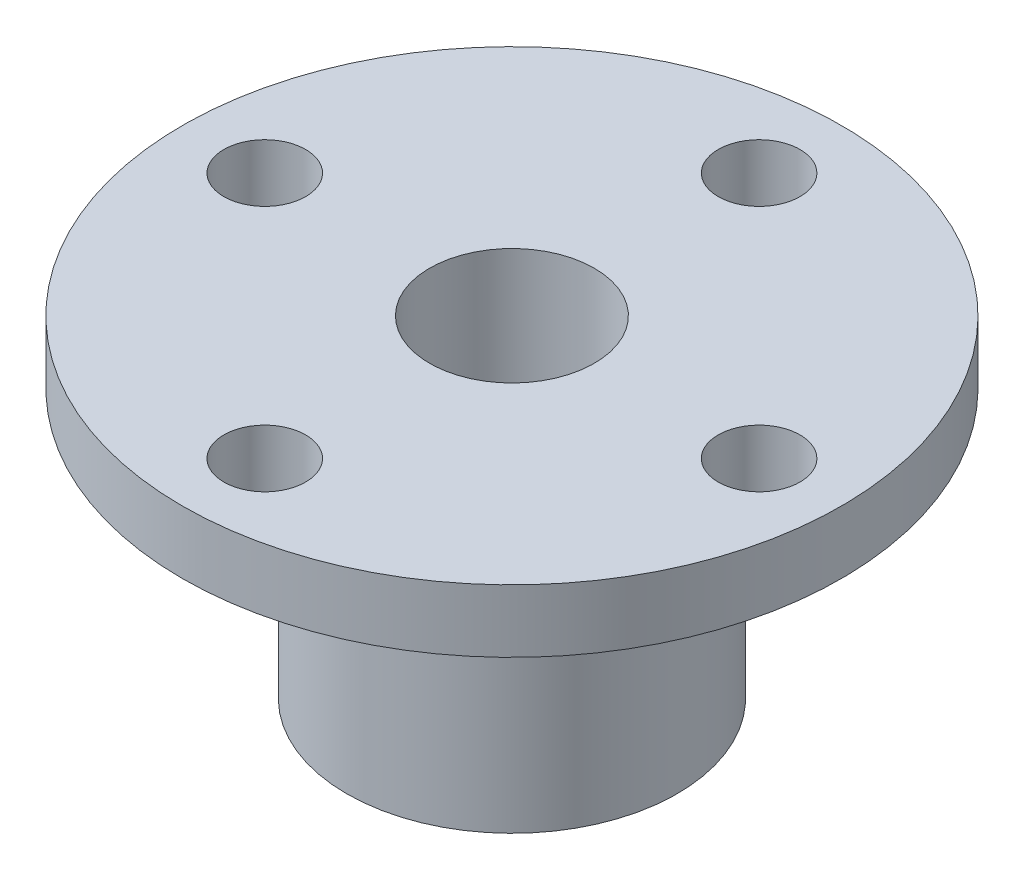
ISO-10303-21;
HEADER;
FILE_DESCRIPTION(('STEP AP214'),'2;1');
FILE_NAME('part.step','',(''),(''),'','','');
FILE_SCHEMA(('AUTOMOTIVE_DESIGN { 1 0 10303 214 1 1 1 1 }'));
ENDSEC;
DATA;
#1=APPLICATION_CONTEXT('core data for automotive mechanical design processes');
#2=APPLICATION_PROTOCOL_DEFINITION('international standard','automotive_design',2000,#1);
#3=PRODUCT_CONTEXT('',#1,'mechanical');
#4=PRODUCT('Part','Part','',(#3));
#5=PRODUCT_RELATED_PRODUCT_CATEGORY('part','',(#4));
#6=PRODUCT_DEFINITION_FORMATION('','',#4);
#7=PRODUCT_DEFINITION_CONTEXT('part definition',#1,'design');
#8=PRODUCT_DEFINITION('design','',#6,#7);
#9=PRODUCT_DEFINITION_SHAPE('','',#8);
#10=(LENGTH_UNIT() NAMED_UNIT(*) SI_UNIT(.MILLI.,.METRE.));
#11=(NAMED_UNIT(*) PLANE_ANGLE_UNIT() SI_UNIT($,.RADIAN.));
#12=(NAMED_UNIT(*) SI_UNIT($,.STERADIAN.) SOLID_ANGLE_UNIT());
#13=UNCERTAINTY_MEASURE_WITH_UNIT(LENGTH_MEASURE(1.E-05),#10,'distance_accuracy_value','');
#14=(GEOMETRIC_REPRESENTATION_CONTEXT(3) GLOBAL_UNCERTAINTY_ASSIGNED_CONTEXT((#13)) GLOBAL_UNIT_ASSIGNED_CONTEXT((#10,
#11,#12)) REPRESENTATION_CONTEXT('',''));
#15=CARTESIAN_POINT('',(0.,0.,0.));
#16=DIRECTION('',(0.,0.,1.));
#17=DIRECTION('',(1.,0.,0.));
#18=AXIS2_PLACEMENT_3D('',#15,#16,#17);
#19=CARTESIAN_POINT('',(0.,0.,0.));
#20=DIRECTION('',(0.,1.,0.));
#21=DIRECTION('',(0.,0.,1.));
#22=AXIS2_PLACEMENT_3D('',#19,#20,#21);
#23=PLANE('',#22);
#24=CARTESIAN_POINT('',(0.,0.,0.));
#25=DIRECTION('',(0.,1.,0.));
#26=DIRECTION('',(0.,0.,1.));
#27=AXIS2_PLACEMENT_3D('',#24,#25,#26);
#28=CIRCLE('',#27,8.02);
#29=CARTESIAN_POINT('',(0.,0.,8.02));
#30=VERTEX_POINT('',#29);
#31=EDGE_CURVE('E40',#30,#30,#28,.T.);
#32=ORIENTED_EDGE('',*,*,#31,.F.);
#33=EDGE_LOOP('',(#32));
#34=FACE_BOUND('',#33,.T.);
#35=CARTESIAN_POINT('',(0.,0.,0.));
#36=DIRECTION('',(0.,1.,0.));
#37=DIRECTION('',(0.,0.,1.));
#38=AXIS2_PLACEMENT_3D('',#35,#36,#37);
#39=CIRCLE('',#38,4.);
#40=CARTESIAN_POINT('',(0.,0.,4.));
#41=VERTEX_POINT('',#40);
#42=EDGE_CURVE('E45',#41,#41,#39,.T.);
#43=ORIENTED_EDGE('',*,*,#42,.T.);
#44=EDGE_LOOP('',(#43));
#45=FACE_BOUND('',#44,.T.);
#46=ADVANCED_FACE('F32',(#34,#45),#23,.F.);
#47=CARTESIAN_POINT('',(0.,13.04,0.));
#48=DIRECTION('',(0.,-1.,0.));
#49=DIRECTION('',(0.,0.,-1.));
#50=AXIS2_PLACEMENT_3D('',#47,#48,#49);
#51=CYLINDRICAL_SURFACE('',#50,8.02);
#52=CARTESIAN_POINT('',(0.,13.04,0.));
#53=DIRECTION('',(0.,1.,0.));
#54=DIRECTION('',(0.,0.,1.));
#55=AXIS2_PLACEMENT_3D('',#52,#53,#54);
#56=CIRCLE('',#55,8.02);
#57=CARTESIAN_POINT('',(0.,13.04,8.02));
#58=VERTEX_POINT('',#57);
#59=EDGE_CURVE('E10',#58,#58,#56,.T.);
#60=ORIENTED_EDGE('',*,*,#59,.F.);
#61=EDGE_LOOP('',(#60));
#62=FACE_BOUND('',#61,.T.);
#63=ORIENTED_EDGE('',*,*,#31,.T.);
#64=EDGE_LOOP('',(#63));
#65=FACE_BOUND('',#64,.T.);
#66=ADVANCED_FACE('F34',(#62,#65),#51,.T.);
#67=CARTESIAN_POINT('',(0.,13.04,0.));
#68=DIRECTION('',(0.,-1.,0.));
#69=DIRECTION('',(0.,0.,-1.));
#70=AXIS2_PLACEMENT_3D('',#67,#68,#69);
#71=CYLINDRICAL_SURFACE('',#70,4.);
#72=ORIENTED_EDGE('',*,*,#42,.F.);
#73=EDGE_LOOP('',(#72));
#74=FACE_BOUND('',#73,.T.);
#75=CARTESIAN_POINT('',(0.,16.09,0.));
#76=DIRECTION('',(0.,-1.,0.));
#77=DIRECTION('',(0.,0.,-1.));
#78=AXIS2_PLACEMENT_3D('',#75,#76,#77);
#79=CIRCLE('',#78,4.);
#80=CARTESIAN_POINT('',(0.,16.09,-4.));
#81=VERTEX_POINT('',#80);
#82=EDGE_CURVE('E61',#81,#81,#79,.T.);
#83=ORIENTED_EDGE('',*,*,#82,.F.);
#84=EDGE_LOOP('',(#83));
#85=FACE_BOUND('',#84,.T.);
#86=ADVANCED_FACE('F82',(#74,#85),#71,.F.);
#87=CARTESIAN_POINT('',(0.,16.09,0.));
#88=DIRECTION('',(0.,-1.,0.));
#89=DIRECTION('',(0.,0.,-1.));
#90=AXIS2_PLACEMENT_3D('',#87,#88,#89);
#91=CYLINDRICAL_SURFACE('',#90,16.);
#92=CARTESIAN_POINT('',(0.,16.09,0.));
#93=DIRECTION('',(0.,1.,0.));
#94=DIRECTION('',(0.,0.,1.));
#95=AXIS2_PLACEMENT_3D('',#92,#93,#94);
#96=CIRCLE('',#95,16.);
#97=CARTESIAN_POINT('',(0.,16.09,16.));
#98=VERTEX_POINT('',#97);
#99=EDGE_CURVE('E70',#98,#98,#96,.T.);
#100=ORIENTED_EDGE('',*,*,#99,.F.);
#101=EDGE_LOOP('',(#100));
#102=FACE_BOUND('',#101,.T.);
#103=CARTESIAN_POINT('',(0.,13.04,0.));
#104=DIRECTION('',(0.,1.,0.));
#105=DIRECTION('',(0.,0.,1.));
#106=AXIS2_PLACEMENT_3D('',#103,#104,#105);
#107=CIRCLE('',#106,16.);
#108=CARTESIAN_POINT('',(0.,13.04,16.));
#109=VERTEX_POINT('',#108);
#110=EDGE_CURVE('E65',#109,#109,#107,.T.);
#111=ORIENTED_EDGE('',*,*,#110,.T.);
#112=EDGE_LOOP('',(#111));
#113=FACE_BOUND('',#112,.T.);
#114=ADVANCED_FACE('F85',(#102,#113),#91,.T.);
#115=CARTESIAN_POINT('',(0.,16.09,0.));
#116=DIRECTION('',(0.,1.,0.));
#117=DIRECTION('',(0.,0.,1.));
#118=AXIS2_PLACEMENT_3D('',#115,#116,#117);
#119=PLANE('',#118);
#120=CARTESIAN_POINT('',(-12.,16.09,0.));
#121=DIRECTION('',(0.,1.,0.));
#122=DIRECTION('',(0.,0.,1.));
#123=AXIS2_PLACEMENT_3D('',#120,#121,#122);
#124=CIRCLE('',#123,1.985);
#125=CARTESIAN_POINT('',(-12.,16.09,1.985));
#126=VERTEX_POINT('',#125);
#127=EDGE_CURVE('E54',#126,#126,#124,.T.);
#128=ORIENTED_EDGE('',*,*,#127,.F.);
#129=EDGE_LOOP('',(#128));
#130=FACE_BOUND('',#129,.T.);
#131=CARTESIAN_POINT('',(0.,16.09,-12.));
#132=DIRECTION('',(0.,1.,0.));
#133=DIRECTION('',(0.,0.,1.));
#134=AXIS2_PLACEMENT_3D('',#131,#132,#133);
#135=CIRCLE('',#134,1.985);
#136=CARTESIAN_POINT('',(0.,16.09,-10.015));
#137=VERTEX_POINT('',#136);
#138=EDGE_CURVE('E181',#137,#137,#135,.T.);
#139=ORIENTED_EDGE('',*,*,#138,.F.);
#140=EDGE_LOOP('',(#139));
#141=FACE_BOUND('',#140,.T.);
#142=CARTESIAN_POINT('',(12.,16.09,0.));
#143=DIRECTION('',(0.,1.,0.));
#144=DIRECTION('',(0.,0.,1.));
#145=AXIS2_PLACEMENT_3D('',#142,#143,#144);
#146=CIRCLE('',#145,1.985);
#147=CARTESIAN_POINT('',(12.,16.09,1.985));
#148=VERTEX_POINT('',#147);
#149=EDGE_CURVE('E184',#148,#148,#146,.T.);
#150=ORIENTED_EDGE('',*,*,#149,.F.);
#151=EDGE_LOOP('',(#150));
#152=FACE_BOUND('',#151,.T.);
#153=CARTESIAN_POINT('',(0.,16.09,12.));
#154=DIRECTION('',(0.,1.,0.));
#155=DIRECTION('',(0.,0.,1.));
#156=AXIS2_PLACEMENT_3D('',#153,#154,#155);
#157=CIRCLE('',#156,1.985);
#158=CARTESIAN_POINT('',(0.,16.09,13.985));
#159=VERTEX_POINT('',#158);
#160=EDGE_CURVE('E73',#159,#159,#157,.T.);
#161=ORIENTED_EDGE('',*,*,#160,.F.);
#162=EDGE_LOOP('',(#161));
#163=FACE_BOUND('',#162,.T.);
#164=ORIENTED_EDGE('',*,*,#82,.T.);
#165=EDGE_LOOP('',(#164));
#166=FACE_BOUND('',#165,.T.);
#167=ORIENTED_EDGE('',*,*,#99,.T.);
#168=EDGE_LOOP('',(#167));
#169=FACE_BOUND('',#168,.T.);
#170=ADVANCED_FACE('F91',(#130,#141,#152,#163,#166,#169),#119,.T.);
#171=CARTESIAN_POINT('',(0.,13.04,0.));
#172=DIRECTION('',(0.,1.,0.));
#173=DIRECTION('',(0.,0.,1.));
#174=AXIS2_PLACEMENT_3D('',#171,#172,#173);
#175=PLANE('',#174);
#176=CARTESIAN_POINT('',(-12.,13.04,0.));
#177=DIRECTION('',(0.,1.,0.));
#178=DIRECTION('',(0.,0.,1.));
#179=AXIS2_PLACEMENT_3D('',#176,#177,#178);
#180=CIRCLE('',#179,1.985);
#181=CARTESIAN_POINT('',(-12.,13.04,1.985));
#182=VERTEX_POINT('',#181);
#183=EDGE_CURVE('E36',#182,#182,#180,.T.);
#184=ORIENTED_EDGE('',*,*,#183,.T.);
#185=EDGE_LOOP('',(#184));
#186=FACE_BOUND('',#185,.T.);
#187=CARTESIAN_POINT('',(0.,13.04,-12.));
#188=DIRECTION('',(0.,1.,0.));
#189=DIRECTION('',(0.,0.,1.));
#190=AXIS2_PLACEMENT_3D('',#187,#188,#189);
#191=CIRCLE('',#190,1.985);
#192=CARTESIAN_POINT('',(0.,13.04,-10.015));
#193=VERTEX_POINT('',#192);
#194=EDGE_CURVE('E56',#193,#193,#191,.T.);
#195=ORIENTED_EDGE('',*,*,#194,.T.);
#196=EDGE_LOOP('',(#195));
#197=FACE_BOUND('',#196,.T.);
#198=CARTESIAN_POINT('',(12.,13.04,0.));
#199=DIRECTION('',(0.,1.,0.));
#200=DIRECTION('',(0.,0.,1.));
#201=AXIS2_PLACEMENT_3D('',#198,#199,#200);
#202=CIRCLE('',#201,1.985);
#203=CARTESIAN_POINT('',(12.,13.04,1.985));
#204=VERTEX_POINT('',#203);
#205=EDGE_CURVE('E53',#204,#204,#202,.T.);
#206=ORIENTED_EDGE('',*,*,#205,.T.);
#207=EDGE_LOOP('',(#206));
#208=FACE_BOUND('',#207,.T.);
#209=CARTESIAN_POINT('',(0.,13.04,12.));
#210=DIRECTION('',(0.,1.,0.));
#211=DIRECTION('',(0.,0.,1.));
#212=AXIS2_PLACEMENT_3D('',#209,#210,#211);
#213=CIRCLE('',#212,1.985);
#214=CARTESIAN_POINT('',(0.,13.04,13.985));
#215=VERTEX_POINT('',#214);
#216=EDGE_CURVE('E50',#215,#215,#213,.T.);
#217=ORIENTED_EDGE('',*,*,#216,.T.);
#218=EDGE_LOOP('',(#217));
#219=FACE_BOUND('',#218,.T.);
#220=ORIENTED_EDGE('',*,*,#59,.T.);
#221=EDGE_LOOP('',(#220));
#222=FACE_BOUND('',#221,.T.);
#223=ORIENTED_EDGE('',*,*,#110,.F.);
#224=EDGE_LOOP('',(#223));
#225=FACE_BOUND('',#224,.T.);
#226=ADVANCED_FACE('F127',(#186,#197,#208,#219,#222,#225),#175,.F.);
#227=CARTESIAN_POINT('',(0.,0.,12.));
#228=DIRECTION('',(0.,1.,0.));
#229=DIRECTION('',(0.,0.,1.));
#230=AXIS2_PLACEMENT_3D('',#227,#228,#229);
#231=CYLINDRICAL_SURFACE('',#230,1.985);
#232=ORIENTED_EDGE('',*,*,#160,.T.);
#233=EDGE_LOOP('',(#232));
#234=FACE_BOUND('',#233,.T.);
#235=ORIENTED_EDGE('',*,*,#216,.F.);
#236=EDGE_LOOP('',(#235));
#237=FACE_BOUND('',#236,.T.);
#238=ADVANCED_FACE('F136',(#234,#237),#231,.F.);
#239=CARTESIAN_POINT('',(12.,0.,0.));
#240=DIRECTION('',(0.,1.,0.));
#241=DIRECTION('',(0.,0.,1.));
#242=AXIS2_PLACEMENT_3D('',#239,#240,#241);
#243=CYLINDRICAL_SURFACE('',#242,1.985);
#244=ORIENTED_EDGE('',*,*,#149,.T.);
#245=EDGE_LOOP('',(#244));
#246=FACE_BOUND('',#245,.T.);
#247=ORIENTED_EDGE('',*,*,#205,.F.);
#248=EDGE_LOOP('',(#247));
#249=FACE_BOUND('',#248,.T.);
#250=ADVANCED_FACE('F144',(#246,#249),#243,.F.);
#251=CARTESIAN_POINT('',(0.,0.,-12.));
#252=DIRECTION('',(0.,1.,0.));
#253=DIRECTION('',(0.,0.,1.));
#254=AXIS2_PLACEMENT_3D('',#251,#252,#253);
#255=CYLINDRICAL_SURFACE('',#254,1.985);
#256=ORIENTED_EDGE('',*,*,#138,.T.);
#257=EDGE_LOOP('',(#256));
#258=FACE_BOUND('',#257,.T.);
#259=ORIENTED_EDGE('',*,*,#194,.F.);
#260=EDGE_LOOP('',(#259));
#261=FACE_BOUND('',#260,.T.);
#262=ADVANCED_FACE('F154',(#258,#261),#255,.F.);
#263=CARTESIAN_POINT('',(-12.,0.,0.));
#264=DIRECTION('',(0.,1.,0.));
#265=DIRECTION('',(0.,0.,1.));
#266=AXIS2_PLACEMENT_3D('',#263,#264,#265);
#267=CYLINDRICAL_SURFACE('',#266,1.985);
#268=ORIENTED_EDGE('',*,*,#127,.T.);
#269=EDGE_LOOP('',(#268));
#270=FACE_BOUND('',#269,.T.);
#271=ORIENTED_EDGE('',*,*,#183,.F.);
#272=EDGE_LOOP('',(#271));
#273=FACE_BOUND('',#272,.T.);
#274=ADVANCED_FACE('F164',(#270,#273),#267,.F.);
#275=CLOSED_SHELL('',(#46,#66,#86,#114,#170,#226,#238,#250,#262,#274));
#276=MANIFOLD_SOLID_BREP('B2',#275);
#277=ADVANCED_BREP_SHAPE_REPRESENTATION('',(#18,#276),#14);
#278=SHAPE_DEFINITION_REPRESENTATION(#9,#277);
ENDSEC;
END-ISO-10303-21;
